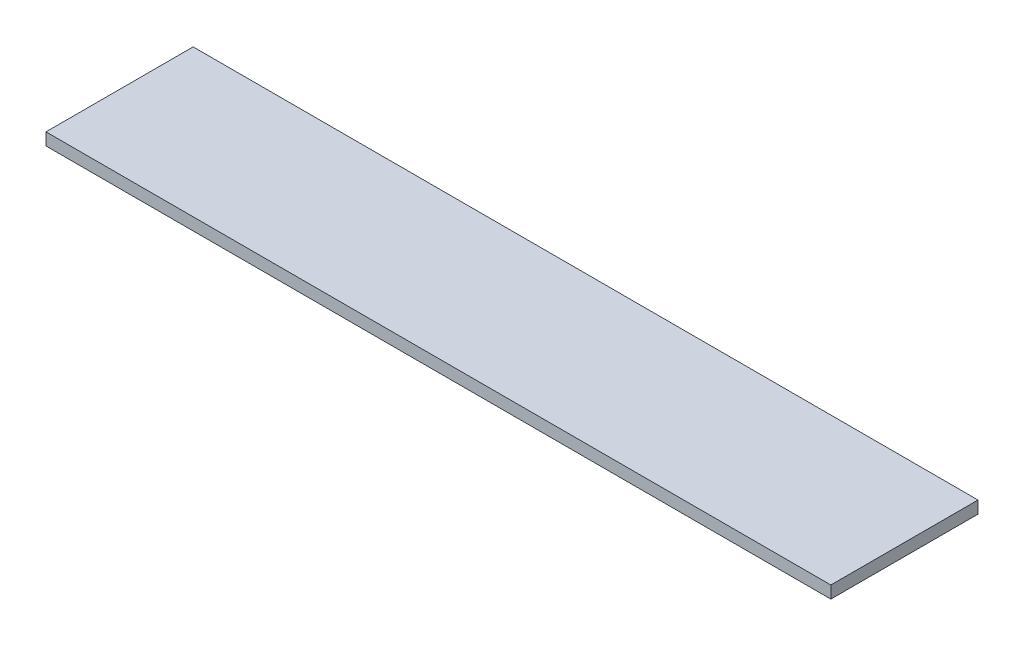
ISO-10303-21;
HEADER;
FILE_DESCRIPTION(('STEP AP214'),'2;1');
FILE_NAME('part.step','',(''),(''),'','','');
FILE_SCHEMA(('AUTOMOTIVE_DESIGN { 1 0 10303 214 1 1 1 1 }'));
ENDSEC;
DATA;
#1=APPLICATION_CONTEXT('core data for automotive mechanical design processes');
#2=APPLICATION_PROTOCOL_DEFINITION('international standard','automotive_design',2000,#1);
#3=PRODUCT_CONTEXT('',#1,'mechanical');
#4=PRODUCT('Part','Part','',(#3));
#5=PRODUCT_RELATED_PRODUCT_CATEGORY('part','',(#4));
#6=PRODUCT_DEFINITION_FORMATION('','',#4);
#7=PRODUCT_DEFINITION_CONTEXT('part definition',#1,'design');
#8=PRODUCT_DEFINITION('design','',#6,#7);
#9=PRODUCT_DEFINITION_SHAPE('','',#8);
#10=(LENGTH_UNIT() NAMED_UNIT(*) SI_UNIT(.MILLI.,.METRE.));
#11=(NAMED_UNIT(*) PLANE_ANGLE_UNIT() SI_UNIT($,.RADIAN.));
#12=(NAMED_UNIT(*) SI_UNIT($,.STERADIAN.) SOLID_ANGLE_UNIT());
#13=UNCERTAINTY_MEASURE_WITH_UNIT(LENGTH_MEASURE(1.E-05),#10,'distance_accuracy_value','');
#14=(GEOMETRIC_REPRESENTATION_CONTEXT(3) GLOBAL_UNCERTAINTY_ASSIGNED_CONTEXT((#13)) GLOBAL_UNIT_ASSIGNED_CONTEXT((#10,
#11,#12)) REPRESENTATION_CONTEXT('',''));
#15=CARTESIAN_POINT('',(0.,0.,0.));
#16=DIRECTION('',(0.,0.,1.));
#17=DIRECTION('',(1.,0.,0.));
#18=AXIS2_PLACEMENT_3D('',#15,#16,#17);
#19=CARTESIAN_POINT('',(0.,6.35,0.));
#20=DIRECTION('',(1.,0.,0.));
#21=DIRECTION('',(0.,0.,-1.));
#22=AXIS2_PLACEMENT_3D('',#19,#20,#21);
#23=PLANE('',#22);
#24=DIRECTION('',(0.,0.,1.));
#25=VECTOR('',#24,1.);
#26=CARTESIAN_POINT('',(0.,0.,0.));
#27=LINE('',#26,#25);
#28=CARTESIAN_POINT('',(0.,0.,-76.2));
#29=VERTEX_POINT('',#28);
#30=CARTESIAN_POINT('',(0.,0.,0.));
#31=VERTEX_POINT('',#30);
#32=EDGE_CURVE('E100',#29,#31,#27,.T.);
#33=ORIENTED_EDGE('',*,*,#32,.T.);
#34=DIRECTION('',(0.,-1.,0.));
#35=VECTOR('',#34,1.);
#36=CARTESIAN_POINT('',(0.,6.35,0.));
#37=LINE('',#36,#35);
#38=CARTESIAN_POINT('',(0.,6.35,0.));
#39=VERTEX_POINT('',#38);
#40=EDGE_CURVE('E11',#39,#31,#37,.T.);
#41=ORIENTED_EDGE('',*,*,#40,.F.);
#42=DIRECTION('',(0.,0.,1.));
#43=VECTOR('',#42,1.);
#44=CARTESIAN_POINT('',(0.,6.35,0.));
#45=LINE('',#44,#43);
#46=CARTESIAN_POINT('',(0.,6.35,-76.2));
#47=VERTEX_POINT('',#46);
#48=EDGE_CURVE('E88',#47,#39,#45,.T.);
#49=ORIENTED_EDGE('',*,*,#48,.F.);
#50=DIRECTION('',(0.,-1.,0.));
#51=VECTOR('',#50,1.);
#52=CARTESIAN_POINT('',(0.,6.35,-76.2));
#53=LINE('',#52,#51);
#54=EDGE_CURVE('E96',#47,#29,#53,.T.);
#55=ORIENTED_EDGE('',*,*,#54,.T.);
#56=EDGE_LOOP('',(#33,#41,#49,#55));
#57=FACE_BOUND('',#56,.T.);
#58=ADVANCED_FACE('F37',(#57),#23,.F.);
#59=CARTESIAN_POINT('',(0.,6.35,0.));
#60=DIRECTION('',(0.,0.,-1.));
#61=DIRECTION('',(-1.,0.,0.));
#62=AXIS2_PLACEMENT_3D('',#59,#60,#61);
#63=PLANE('',#62);
#64=DIRECTION('',(1.,0.,0.));
#65=VECTOR('',#64,1.);
#66=CARTESIAN_POINT('',(0.,0.,0.));
#67=LINE('',#66,#65);
#68=CARTESIAN_POINT('',(406.4,0.,0.));
#69=VERTEX_POINT('',#68);
#70=EDGE_CURVE('E92',#31,#69,#67,.T.);
#71=ORIENTED_EDGE('',*,*,#70,.T.);
#72=DIRECTION('',(0.,-1.,0.));
#73=VECTOR('',#72,1.);
#74=CARTESIAN_POINT('',(406.4,6.35,0.));
#75=LINE('',#74,#73);
#76=CARTESIAN_POINT('',(406.4,6.35,0.));
#77=VERTEX_POINT('',#76);
#78=EDGE_CURVE('E45',#77,#69,#75,.T.);
#79=ORIENTED_EDGE('',*,*,#78,.F.);
#80=DIRECTION('',(1.,0.,0.));
#81=VECTOR('',#80,1.);
#82=CARTESIAN_POINT('',(0.,6.35,0.));
#83=LINE('',#82,#81);
#84=EDGE_CURVE('E83',#39,#77,#83,.T.);
#85=ORIENTED_EDGE('',*,*,#84,.F.);
#86=ORIENTED_EDGE('',*,*,#40,.T.);
#87=EDGE_LOOP('',(#71,#79,#85,#86));
#88=FACE_BOUND('',#87,.T.);
#89=ADVANCED_FACE('F91',(#88),#63,.F.);
#90=CARTESIAN_POINT('',(406.4,6.35,0.));
#91=DIRECTION('',(-1.,0.,0.));
#92=DIRECTION('',(0.,0.,1.));
#93=AXIS2_PLACEMENT_3D('',#90,#91,#92);
#94=PLANE('',#93);
#95=DIRECTION('',(0.,0.,-1.));
#96=VECTOR('',#95,1.);
#97=CARTESIAN_POINT('',(406.4,0.,0.));
#98=LINE('',#97,#96);
#99=CARTESIAN_POINT('',(406.4,0.,-76.2));
#100=VERTEX_POINT('',#99);
#101=EDGE_CURVE('E70',#69,#100,#98,.T.);
#102=ORIENTED_EDGE('',*,*,#101,.T.);
#103=DIRECTION('',(0.,-1.,0.));
#104=VECTOR('',#103,1.);
#105=CARTESIAN_POINT('',(406.4,6.35,-76.2));
#106=LINE('',#105,#104);
#107=CARTESIAN_POINT('',(406.4,6.35,-76.2));
#108=VERTEX_POINT('',#107);
#109=EDGE_CURVE('E93',#108,#100,#106,.T.);
#110=ORIENTED_EDGE('',*,*,#109,.F.);
#111=DIRECTION('',(0.,0.,-1.));
#112=VECTOR('',#111,1.);
#113=CARTESIAN_POINT('',(406.4,6.35,0.));
#114=LINE('',#113,#112);
#115=EDGE_CURVE('E86',#77,#108,#114,.T.);
#116=ORIENTED_EDGE('',*,*,#115,.F.);
#117=ORIENTED_EDGE('',*,*,#78,.T.);
#118=EDGE_LOOP('',(#102,#110,#116,#117));
#119=FACE_BOUND('',#118,.T.);
#120=ADVANCED_FACE('F94',(#119),#94,.F.);
#121=CARTESIAN_POINT('',(0.,6.35,-76.2));
#122=DIRECTION('',(0.,0.,1.));
#123=DIRECTION('',(1.,0.,0.));
#124=AXIS2_PLACEMENT_3D('',#121,#122,#123);
#125=PLANE('',#124);
#126=DIRECTION('',(-1.,0.,0.));
#127=VECTOR('',#126,1.);
#128=CARTESIAN_POINT('',(0.,0.,-76.2));
#129=LINE('',#128,#127);
#130=EDGE_CURVE('E76',#100,#29,#129,.T.);
#131=ORIENTED_EDGE('',*,*,#130,.T.);
#132=ORIENTED_EDGE('',*,*,#54,.F.);
#133=DIRECTION('',(-1.,0.,0.));
#134=VECTOR('',#133,1.);
#135=CARTESIAN_POINT('',(0.,6.35,-76.2));
#136=LINE('',#135,#134);
#137=EDGE_CURVE('E53',#108,#47,#136,.T.);
#138=ORIENTED_EDGE('',*,*,#137,.F.);
#139=ORIENTED_EDGE('',*,*,#109,.T.);
#140=EDGE_LOOP('',(#131,#132,#138,#139));
#141=FACE_BOUND('',#140,.T.);
#142=ADVANCED_FACE('F107',(#141),#125,.F.);
#143=CARTESIAN_POINT('',(0.,6.35,0.));
#144=DIRECTION('',(0.,-1.,0.));
#145=DIRECTION('',(0.,0.,-1.));
#146=AXIS2_PLACEMENT_3D('',#143,#144,#145);
#147=PLANE('',#146);
#148=ORIENTED_EDGE('',*,*,#48,.T.);
#149=ORIENTED_EDGE('',*,*,#84,.T.);
#150=ORIENTED_EDGE('',*,*,#115,.T.);
#151=ORIENTED_EDGE('',*,*,#137,.T.);
#152=EDGE_LOOP('',(#148,#149,#150,#151));
#153=FACE_BOUND('',#152,.T.);
#154=ADVANCED_FACE('F84',(#153),#147,.F.);
#155=CARTESIAN_POINT('',(0.,0.,0.));
#156=DIRECTION('',(0.,-1.,0.));
#157=DIRECTION('',(0.,0.,-1.));
#158=AXIS2_PLACEMENT_3D('',#155,#156,#157);
#159=PLANE('',#158);
#160=ORIENTED_EDGE('',*,*,#32,.F.);
#161=ORIENTED_EDGE('',*,*,#130,.F.);
#162=ORIENTED_EDGE('',*,*,#101,.F.);
#163=ORIENTED_EDGE('',*,*,#70,.F.);
#164=EDGE_LOOP('',(#160,#161,#162,#163));
#165=FACE_BOUND('',#164,.T.);
#166=ADVANCED_FACE('F110',(#165),#159,.T.);
#167=CLOSED_SHELL('',(#58,#89,#120,#142,#154,#166));
#168=MANIFOLD_SOLID_BREP('B2',#167);
#169=ADVANCED_BREP_SHAPE_REPRESENTATION('',(#18,#168),#14);
#170=SHAPE_DEFINITION_REPRESENTATION(#9,#169);
ENDSEC;
END-ISO-10303-21;
